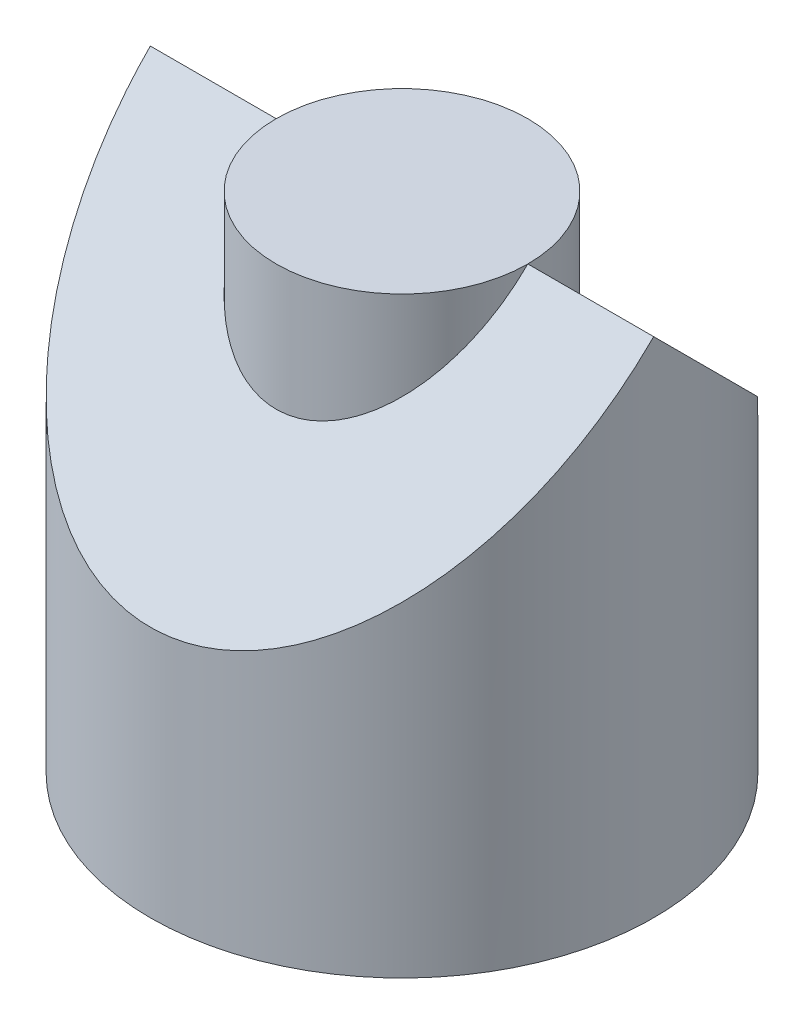
ISO-10303-21;
HEADER;
FILE_DESCRIPTION(('STEP AP214'),'2;1');
FILE_NAME('part.step','',(''),(''),'','','');
FILE_SCHEMA(('AUTOMOTIVE_DESIGN { 1 0 10303 214 1 1 1 1 }'));
ENDSEC;
DATA;
#1=APPLICATION_CONTEXT('core data for automotive mechanical design processes');
#2=APPLICATION_PROTOCOL_DEFINITION('international standard','automotive_design',2000,#1);
#3=PRODUCT_CONTEXT('',#1,'mechanical');
#4=PRODUCT('Part','Part','',(#3));
#5=PRODUCT_RELATED_PRODUCT_CATEGORY('part','',(#4));
#6=PRODUCT_DEFINITION_FORMATION('','',#4);
#7=PRODUCT_DEFINITION_CONTEXT('part definition',#1,'design');
#8=PRODUCT_DEFINITION('design','',#6,#7);
#9=PRODUCT_DEFINITION_SHAPE('','',#8);
#10=(LENGTH_UNIT() NAMED_UNIT(*) SI_UNIT(.MILLI.,.METRE.));
#11=(NAMED_UNIT(*) PLANE_ANGLE_UNIT() SI_UNIT($,.RADIAN.));
#12=(NAMED_UNIT(*) SI_UNIT($,.STERADIAN.) SOLID_ANGLE_UNIT());
#13=UNCERTAINTY_MEASURE_WITH_UNIT(LENGTH_MEASURE(1.E-05),#10,'distance_accuracy_value','');
#14=(GEOMETRIC_REPRESENTATION_CONTEXT(3) GLOBAL_UNCERTAINTY_ASSIGNED_CONTEXT((#13)) GLOBAL_UNIT_ASSIGNED_CONTEXT((#10,
#11,#12)) REPRESENTATION_CONTEXT('',''));
#15=CARTESIAN_POINT('',(0.,0.,0.));
#16=DIRECTION('',(0.,0.,1.));
#17=DIRECTION('',(1.,0.,0.));
#18=AXIS2_PLACEMENT_3D('',#15,#16,#17);
#19=CARTESIAN_POINT('',(0.,4.,0.));
#20=DIRECTION('',(0.,-1.,0.));
#21=DIRECTION('',(0.,0.,-1.));
#22=AXIS2_PLACEMENT_3D('',#19,#20,#21);
#23=CYLINDRICAL_SURFACE('',#22,1.);
#24=CARTESIAN_POINT('',(0.,4.,0.));
#25=DIRECTION('',(0.,-1.,0.));
#26=DIRECTION('',(0.,0.,-1.));
#27=AXIS2_PLACEMENT_3D('',#24,#25,#26);
#28=CIRCLE('',#27,1.);
#29=CARTESIAN_POINT('',(0.,4.,-1.));
#30=VERTEX_POINT('',#29);
#31=EDGE_CURVE('E12',#30,#30,#28,.T.);
#32=ORIENTED_EDGE('',*,*,#31,.T.);
#33=EDGE_LOOP('',(#32));
#34=FACE_BOUND('',#33,.T.);
#35=CARTESIAN_POINT('',(0.,0.,0.));
#36=DIRECTION('',(0.,-1.,0.));
#37=DIRECTION('',(0.,0.,-1.));
#38=AXIS2_PLACEMENT_3D('',#35,#36,#37);
#39=CIRCLE('',#38,1.);
#40=CARTESIAN_POINT('',(0.,0.,-1.));
#41=VERTEX_POINT('',#40);
#42=EDGE_CURVE('E45',#41,#41,#39,.T.);
#43=ORIENTED_EDGE('',*,*,#42,.F.);
#44=EDGE_LOOP('',(#43));
#45=FACE_BOUND('',#44,.T.);
#46=ADVANCED_FACE('F42',(#34,#45),#23,.T.);
#47=CARTESIAN_POINT('',(0.,4.,0.));
#48=DIRECTION('',(0.,-1.,0.));
#49=DIRECTION('',(0.,0.,-1.));
#50=AXIS2_PLACEMENT_3D('',#47,#48,#49);
#51=PLANE('',#50);
#52=ORIENTED_EDGE('',*,*,#31,.F.);
#53=EDGE_LOOP('',(#52));
#54=FACE_BOUND('',#53,.T.);
#55=ADVANCED_FACE('F57',(#54),#51,.F.);
#56=CARTESIAN_POINT('',(0.,0.,0.));
#57=DIRECTION('',(0.,-1.,0.));
#58=DIRECTION('',(0.,0.,-1.));
#59=AXIS2_PLACEMENT_3D('',#56,#57,#58);
#60=PLANE('',#59);
#61=ORIENTED_EDGE('',*,*,#42,.T.);
#62=EDGE_LOOP('',(#61));
#63=FACE_BOUND('',#62,.T.);
#64=ADVANCED_FACE('F54',(#63),#60,.T.);
#65=CLOSED_SHELL('',(#46,#55,#64));
#66=MANIFOLD_SOLID_BREP('B2',#65);
#67=CARTESIAN_POINT('',(0.,0.,0.));
#68=DIRECTION('',(0.,1.,0.));
#69=DIRECTION('',(0.,0.,1.));
#70=AXIS2_PLACEMENT_3D('',#67,#68,#69);
#71=PLANE('',#70);
#72=CARTESIAN_POINT('',(0.,0.,0.));
#73=DIRECTION('',(0.,1.,0.));
#74=DIRECTION('',(0.,0.,1.));
#75=AXIS2_PLACEMENT_3D('',#72,#73,#74);
#76=CIRCLE('',#75,2.);
#77=CARTESIAN_POINT('',(0.,0.,2.));
#78=VERTEX_POINT('',#77);
#79=EDGE_CURVE('E91',#78,#78,#76,.T.);
#80=ORIENTED_EDGE('',*,*,#79,.F.);
#81=EDGE_LOOP('',(#80));
#82=FACE_BOUND('',#81,.T.);
#83=CARTESIAN_POINT('',(0.,0.,0.));
#84=DIRECTION('',(0.,1.,0.));
#85=DIRECTION('',(0.,0.,1.));
#86=AXIS2_PLACEMENT_3D('',#83,#84,#85);
#87=CIRCLE('',#86,1.);
#88=CARTESIAN_POINT('',(0.,0.,1.));
#89=VERTEX_POINT('',#88);
#90=EDGE_CURVE('E121',#89,#89,#87,.T.);
#91=ORIENTED_EDGE('',*,*,#90,.T.);
#92=EDGE_LOOP('',(#91));
#93=FACE_BOUND('',#92,.T.);
#94=ADVANCED_FACE('F83',(#82,#93),#71,.F.);
#95=CARTESIAN_POINT('',(0.,4.,0.));
#96=DIRECTION('',(0.,-1.,0.));
#97=DIRECTION('',(0.,0.,-1.));
#98=AXIS2_PLACEMENT_3D('',#95,#96,#97);
#99=CYLINDRICAL_SURFACE('',#98,2.);
#100=CARTESIAN_POINT('',(0.,4.,0.));
#101=DIRECTION('',(0.,-0.707106781186547,-0.707106781186547));
#102=DIRECTION('',(0.,-0.707106781186548,0.707106781186548));
#103=AXIS2_PLACEMENT_3D('',#100,#101,#102);
#104=ELLIPSE('',#103,2.82842712474619,2.);
#105=CARTESIAN_POINT('',(2.,4.,0.));
#106=VERTEX_POINT('',#105);
#107=CARTESIAN_POINT('',(-2.,4.,0.));
#108=VERTEX_POINT('',#107);
#109=EDGE_CURVE('E98',#106,#108,#104,.T.);
#110=ORIENTED_EDGE('',*,*,#109,.T.);
#111=CARTESIAN_POINT('',(0.,4.,0.));
#112=DIRECTION('',(0.,-0.707106781186547,0.707106781186547));
#113=DIRECTION('',(0.,-0.707106781186548,-0.707106781186548));
#114=AXIS2_PLACEMENT_3D('',#111,#112,#113);
#115=ELLIPSE('',#114,2.82842712474619,2.);
#116=EDGE_CURVE('E111',#108,#106,#115,.T.);
#117=ORIENTED_EDGE('',*,*,#116,.T.);
#118=EDGE_LOOP('',(#110,#117));
#119=FACE_BOUND('',#118,.T.);
#120=ORIENTED_EDGE('',*,*,#79,.T.);
#121=EDGE_LOOP('',(#120));
#122=FACE_BOUND('',#121,.T.);
#123=ADVANCED_FACE('F85',(#119,#122),#99,.T.);
#124=CARTESIAN_POINT('',(0.,4.,0.));
#125=DIRECTION('',(0.,-1.,0.));
#126=DIRECTION('',(0.,0.,-1.));
#127=AXIS2_PLACEMENT_3D('',#124,#125,#126);
#128=CYLINDRICAL_SURFACE('',#127,1.);
#129=CARTESIAN_POINT('',(0.,4.,0.));
#130=DIRECTION('',(0.,-0.707106781186547,-0.707106781186547));
#131=DIRECTION('',(0.,-0.707106781186548,0.707106781186548));
#132=AXIS2_PLACEMENT_3D('',#129,#130,#131);
#133=ELLIPSE('',#132,1.4142135623731,1.);
#134=CARTESIAN_POINT('',(1.,4.,0.));
#135=VERTEX_POINT('',#134);
#136=CARTESIAN_POINT('',(-1.,4.,0.));
#137=VERTEX_POINT('',#136);
#138=EDGE_CURVE('E112',#135,#137,#133,.T.);
#139=ORIENTED_EDGE('',*,*,#138,.F.);
#140=CARTESIAN_POINT('',(0.,4.,0.));
#141=DIRECTION('',(0.,-0.707106781186547,0.707106781186547));
#142=DIRECTION('',(0.,-0.707106781186548,-0.707106781186548));
#143=AXIS2_PLACEMENT_3D('',#140,#141,#142);
#144=ELLIPSE('',#143,1.4142135623731,1.);
#145=EDGE_CURVE('E40',#137,#135,#144,.T.);
#146=ORIENTED_EDGE('',*,*,#145,.F.);
#147=EDGE_LOOP('',(#139,#146));
#148=FACE_BOUND('',#147,.T.);
#149=ORIENTED_EDGE('',*,*,#90,.F.);
#150=EDGE_LOOP('',(#149));
#151=FACE_BOUND('',#150,.T.);
#152=ADVANCED_FACE('F132',(#148,#151),#128,.F.);
#153=CARTESIAN_POINT('',(-2.,2.,-2.));
#154=DIRECTION('',(0.,-0.707106781186547,0.707106781186547));
#155=DIRECTION('',(0.,-0.707106781186548,-0.707106781186548));
#156=AXIS2_PLACEMENT_3D('',#153,#154,#155);
#157=PLANE('',#156);
#158=ORIENTED_EDGE('',*,*,#116,.F.);
#159=DIRECTION('',(1.,0.,0.));
#160=VECTOR('',#159,1.);
#161=CARTESIAN_POINT('',(-2.,4.,0.));
#162=LINE('',#161,#160);
#163=EDGE_CURVE('E115',#108,#137,#162,.T.);
#164=ORIENTED_EDGE('',*,*,#163,.T.);
#165=ORIENTED_EDGE('',*,*,#145,.T.);
#166=EDGE_CURVE('E103',#135,#106,#162,.T.);
#167=ORIENTED_EDGE('',*,*,#166,.T.);
#168=EDGE_LOOP('',(#158,#164,#165,#167));
#169=FACE_BOUND('',#168,.T.);
#170=ADVANCED_FACE('F120',(#169),#157,.F.);
#171=CARTESIAN_POINT('',(-2.,2.,2.));
#172=DIRECTION('',(0.,-0.707106781186547,-0.707106781186547));
#173=DIRECTION('',(0.,0.707106781186548,-0.707106781186548));
#174=AXIS2_PLACEMENT_3D('',#171,#172,#173);
#175=PLANE('',#174);
#176=ORIENTED_EDGE('',*,*,#109,.F.);
#177=ORIENTED_EDGE('',*,*,#166,.F.);
#178=ORIENTED_EDGE('',*,*,#138,.T.);
#179=ORIENTED_EDGE('',*,*,#163,.F.);
#180=EDGE_LOOP('',(#176,#177,#178,#179));
#181=FACE_BOUND('',#180,.T.);
#182=ADVANCED_FACE('F116',(#181),#175,.F.);
#183=CLOSED_SHELL('',(#94,#123,#152,#170,#182));
#184=MANIFOLD_SOLID_BREP('B7',#183);
#185=ADVANCED_BREP_SHAPE_REPRESENTATION('',(#18,#66,#184),#14);
#186=SHAPE_DEFINITION_REPRESENTATION(#9,#185);
ENDSEC;
END-ISO-10303-21;
